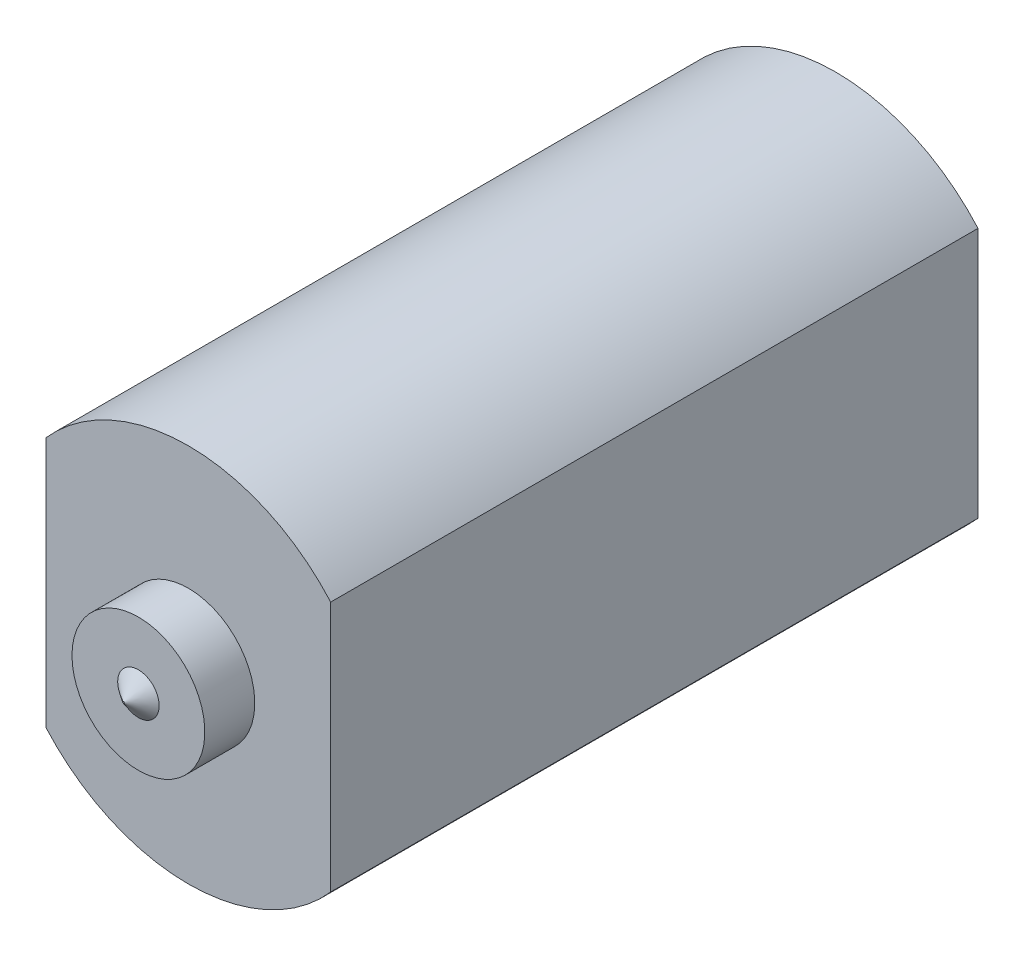
ISO-10303-21;
HEADER;
FILE_DESCRIPTION(('STEP AP214'),'2;1');
FILE_NAME('part.step','',(''),(''),'','','');
FILE_SCHEMA(('AUTOMOTIVE_DESIGN { 1 0 10303 214 1 1 1 1 }'));
ENDSEC;
DATA;
#1=APPLICATION_CONTEXT('core data for automotive mechanical design processes');
#2=APPLICATION_PROTOCOL_DEFINITION('international standard','automotive_design',2000,#1);
#3=PRODUCT_CONTEXT('',#1,'mechanical');
#4=PRODUCT('Part','Part','',(#3));
#5=PRODUCT_RELATED_PRODUCT_CATEGORY('part','',(#4));
#6=PRODUCT_DEFINITION_FORMATION('','',#4);
#7=PRODUCT_DEFINITION_CONTEXT('part definition',#1,'design');
#8=PRODUCT_DEFINITION('design','',#6,#7);
#9=PRODUCT_DEFINITION_SHAPE('','',#8);
#10=(LENGTH_UNIT() NAMED_UNIT(*) SI_UNIT(.MILLI.,.METRE.));
#11=(NAMED_UNIT(*) PLANE_ANGLE_UNIT() SI_UNIT($,.RADIAN.));
#12=(NAMED_UNIT(*) SI_UNIT($,.STERADIAN.) SOLID_ANGLE_UNIT());
#13=UNCERTAINTY_MEASURE_WITH_UNIT(LENGTH_MEASURE(1.E-05),#10,'distance_accuracy_value','');
#14=(GEOMETRIC_REPRESENTATION_CONTEXT(3) GLOBAL_UNCERTAINTY_ASSIGNED_CONTEXT((#13)) GLOBAL_UNIT_ASSIGNED_CONTEXT((#10,
#11,#12)) REPRESENTATION_CONTEXT('',''));
#15=CARTESIAN_POINT('',(0.,0.,0.));
#16=DIRECTION('',(0.,0.,1.));
#17=DIRECTION('',(1.,0.,0.));
#18=AXIS2_PLACEMENT_3D('',#15,#16,#17);
#19=CARTESIAN_POINT('',(0.,0.,6.604));
#20=DIRECTION('',(0.,0.,1.));
#21=DIRECTION('',(1.,0.,0.));
#22=AXIS2_PLACEMENT_3D('',#19,#20,#21);
#23=PLANE('',#22);
#24=CARTESIAN_POINT('',(0.,0.,6.60400000003847));
#25=DIRECTION('',(0.,0.,-1.));
#26=DIRECTION('',(-1.,0.,0.));
#27=AXIS2_PLACEMENT_3D('',#24,#25,#26);
#28=CIRCLE('',#27,0.0857836917589339);
#29=CARTESIAN_POINT('',(-0.0857836917589339,0.,6.60400000003847));
#30=VERTEX_POINT('',#29);
#31=EDGE_CURVE('E19',#30,#30,#28,.T.);
#32=ORIENTED_EDGE('',*,*,#31,.F.);
#33=EDGE_LOOP('',(#32));
#34=FACE_BOUND('',#33,.T.);
#35=ADVANCED_FACE('F16',(#34),#23,.T.);
#36=CARTESIAN_POINT('',(0.,0.,5.07999999990716));
#37=DIRECTION('',(0.,0.,-1.));
#38=DIRECTION('',(-1.,0.,0.));
#39=AXIS2_PLACEMENT_3D('',#36,#37,#38);
#40=CONICAL_SURFACE('',#39,2.10820000012291,0.925024503566552);
#41=CARTESIAN_POINT('',(0.,0.,5.07999999999283));
#42=DIRECTION('',(0.,0.,-1.));
#43=DIRECTION('',(-1.,0.,0.));
#44=AXIS2_PLACEMENT_3D('',#41,#42,#43);
#45=CIRCLE('',#44,2.10820000000922);
#46=CARTESIAN_POINT('',(-2.10820000000922,0.,5.07999999999283));
#47=VERTEX_POINT('',#46);
#48=EDGE_CURVE('E91',#47,#47,#45,.T.);
#49=ORIENTED_EDGE('',*,*,#48,.F.);
#50=EDGE_LOOP('',(#49));
#51=FACE_BOUND('',#50,.T.);
#52=ORIENTED_EDGE('',*,*,#31,.T.);
#53=EDGE_LOOP('',(#52));
#54=FACE_BOUND('',#53,.T.);
#55=ADVANCED_FACE('F98',(#51,#54),#40,.T.);
#56=CARTESIAN_POINT('',(0.,0.,5.08));
#57=DIRECTION('',(0.,0.,1.));
#58=DIRECTION('',(1.,0.,0.));
#59=AXIS2_PLACEMENT_3D('',#56,#57,#58);
#60=PLANE('',#59);
#61=ORIENTED_EDGE('',*,*,#48,.T.);
#62=EDGE_LOOP('',(#61));
#63=FACE_BOUND('',#62,.T.);
#64=CARTESIAN_POINT('',(0.,0.,5.08));
#65=DIRECTION('',(0.,0.,-1.));
#66=DIRECTION('',(-1.,0.,0.));
#67=AXIS2_PLACEMENT_3D('',#64,#65,#66);
#68=CIRCLE('',#67,6.7564);
#69=CARTESIAN_POINT('',(-6.7564,0.,5.08));
#70=VERTEX_POINT('',#69);
#71=EDGE_CURVE('E65',#70,#70,#68,.T.);
#72=ORIENTED_EDGE('',*,*,#71,.F.);
#73=EDGE_LOOP('',(#72));
#74=FACE_BOUND('',#73,.T.);
#75=ADVANCED_FACE('F107',(#63,#74),#60,.T.);
#76=CARTESIAN_POINT('',(0.,0.,5.08));
#77=DIRECTION('',(0.,0.,-1.));
#78=DIRECTION('',(-1.,0.,0.));
#79=AXIS2_PLACEMENT_3D('',#76,#77,#78);
#80=CYLINDRICAL_SURFACE('',#79,6.7564);
#81=CARTESIAN_POINT('',(0.,0.,0.));
#82=DIRECTION('',(0.,0.,-1.));
#83=DIRECTION('',(-1.,0.,0.));
#84=AXIS2_PLACEMENT_3D('',#81,#82,#83);
#85=CIRCLE('',#84,6.7564);
#86=CARTESIAN_POINT('',(-6.7564,0.,0.));
#87=VERTEX_POINT('',#86);
#88=EDGE_CURVE('E64',#87,#87,#85,.T.);
#89=ORIENTED_EDGE('',*,*,#88,.F.);
#90=EDGE_LOOP('',(#89));
#91=FACE_BOUND('',#90,.T.);
#92=ORIENTED_EDGE('',*,*,#71,.T.);
#93=EDGE_LOOP('',(#92));
#94=FACE_BOUND('',#93,.T.);
#95=ADVANCED_FACE('F131',(#91,#94),#80,.T.);
#96=CARTESIAN_POINT('',(0.,0.,-65.8368));
#97=DIRECTION('',(0.,0.,1.));
#98=DIRECTION('',(1.,0.,0.));
#99=AXIS2_PLACEMENT_3D('',#96,#97,#98);
#100=CYLINDRICAL_SURFACE('',#99,19.304);
#101=CARTESIAN_POINT('',(0.,0.,-65.8368));
#102=DIRECTION('',(0.,0.,1.));
#103=DIRECTION('',(1.,0.,0.));
#104=AXIS2_PLACEMENT_3D('',#101,#102,#103);
#105=CIRCLE('',#104,19.304);
#106=CARTESIAN_POINT('',(14.478,12.7683958271977,-65.8368));
#107=VERTEX_POINT('',#106);
#108=CARTESIAN_POINT('',(-14.478,12.7683958271977,-65.8368));
#109=VERTEX_POINT('',#108);
#110=EDGE_CURVE('E83',#107,#109,#105,.T.);
#111=ORIENTED_EDGE('',*,*,#110,.T.);
#112=DIRECTION('',(0.,0.,1.));
#113=VECTOR('',#112,1.);
#114=CARTESIAN_POINT('',(-14.478,12.7683958271977,-65.8368));
#115=LINE('',#114,#113);
#116=CARTESIAN_POINT('',(-14.478,12.7683958271977,0.));
#117=VERTEX_POINT('',#116);
#118=EDGE_CURVE('E61',#117,#109,#115,.F.);
#119=ORIENTED_EDGE('',*,*,#118,.F.);
#120=CARTESIAN_POINT('',(0.,0.,0.));
#121=DIRECTION('',(0.,0.,1.));
#122=DIRECTION('',(1.,0.,0.));
#123=AXIS2_PLACEMENT_3D('',#120,#121,#122);
#124=CIRCLE('',#123,19.304);
#125=CARTESIAN_POINT('',(14.478,12.7683958271977,0.));
#126=VERTEX_POINT('',#125);
#127=EDGE_CURVE('E55',#126,#117,#124,.T.);
#128=ORIENTED_EDGE('',*,*,#127,.F.);
#129=DIRECTION('',(0.,0.,-1.));
#130=VECTOR('',#129,1.);
#131=CARTESIAN_POINT('',(14.478,12.7683958271977,-65.8368));
#132=LINE('',#131,#130);
#133=EDGE_CURVE('E59',#107,#126,#132,.F.);
#134=ORIENTED_EDGE('',*,*,#133,.F.);
#135=EDGE_LOOP('',(#111,#119,#128,#134));
#136=FACE_BOUND('',#135,.T.);
#137=ADVANCED_FACE('F57',(#136),#100,.T.);
#138=CARTESIAN_POINT('',(0.,-42.6102213562373,0.));
#139=DIRECTION('',(0.,0.,1.));
#140=DIRECTION('',(1.,0.,0.));
#141=AXIS2_PLACEMENT_3D('',#138,#139,#140);
#142=PLANE('',#141);
#143=ORIENTED_EDGE('',*,*,#88,.T.);
#144=EDGE_LOOP('',(#143));
#145=FACE_BOUND('',#144,.T.);
#146=DIRECTION('',(0.,1.,0.));
#147=VECTOR('',#146,1.);
#148=CARTESIAN_POINT('',(-14.478,-42.6102213562373,0.));
#149=LINE('',#148,#147);
#150=CARTESIAN_POINT('',(-14.478,-12.7683958271977,0.));
#151=VERTEX_POINT('',#150);
#152=EDGE_CURVE('E84',#151,#117,#149,.T.);
#153=ORIENTED_EDGE('',*,*,#152,.F.);
#154=CARTESIAN_POINT('',(0.,0.,0.));
#155=DIRECTION('',(0.,0.,1.));
#156=DIRECTION('',(1.,0.,0.));
#157=AXIS2_PLACEMENT_3D('',#154,#155,#156);
#158=CIRCLE('',#157,19.304);
#159=CARTESIAN_POINT('',(14.478,-12.7683958271977,0.));
#160=VERTEX_POINT('',#159);
#161=EDGE_CURVE('E71',#160,#151,#158,.F.);
#162=ORIENTED_EDGE('',*,*,#161,.F.);
#163=DIRECTION('',(0.,1.,0.));
#164=VECTOR('',#163,1.);
#165=CARTESIAN_POINT('',(14.478,-42.6102213562373,0.));
#166=LINE('',#165,#164);
#167=EDGE_CURVE('E68',#126,#160,#166,.F.);
#168=ORIENTED_EDGE('',*,*,#167,.F.);
#169=ORIENTED_EDGE('',*,*,#127,.T.);
#170=EDGE_LOOP('',(#153,#162,#168,#169));
#171=FACE_BOUND('',#170,.T.);
#172=ADVANCED_FACE('F69',(#145,#171),#142,.T.);
#173=CARTESIAN_POINT('',(-14.478,-42.6102213562373,-65.8368));
#174=DIRECTION('',(-1.,0.,0.));
#175=DIRECTION('',(0.,0.,1.));
#176=AXIS2_PLACEMENT_3D('',#173,#174,#175);
#177=PLANE('',#176);
#178=DIRECTION('',(0.,1.,0.));
#179=VECTOR('',#178,1.);
#180=CARTESIAN_POINT('',(-14.478,-42.6102213562373,-65.8368));
#181=LINE('',#180,#179);
#182=CARTESIAN_POINT('',(-14.478,-12.7683958271977,-65.8368));
#183=VERTEX_POINT('',#182);
#184=EDGE_CURVE('E73',#109,#183,#181,.F.);
#185=ORIENTED_EDGE('',*,*,#184,.T.);
#186=DIRECTION('',(0.,0.,1.));
#187=VECTOR('',#186,1.);
#188=CARTESIAN_POINT('',(-14.478,-12.7683958271977,-65.8368));
#189=LINE('',#188,#187);
#190=EDGE_CURVE('E77',#151,#183,#189,.F.);
#191=ORIENTED_EDGE('',*,*,#190,.F.);
#192=ORIENTED_EDGE('',*,*,#152,.T.);
#193=ORIENTED_EDGE('',*,*,#118,.T.);
#194=EDGE_LOOP('',(#185,#191,#192,#193));
#195=FACE_BOUND('',#194,.T.);
#196=ADVANCED_FACE('F122',(#195),#177,.T.);
#197=CARTESIAN_POINT('',(0.,-42.6102213562373,-65.8368));
#198=DIRECTION('',(0.,0.,1.));
#199=DIRECTION('',(1.,0.,0.));
#200=AXIS2_PLACEMENT_3D('',#197,#198,#199);
#201=PLANE('',#200);
#202=CARTESIAN_POINT('',(0.,0.,-65.8368));
#203=DIRECTION('',(0.,0.,1.));
#204=DIRECTION('',(1.,0.,0.));
#205=AXIS2_PLACEMENT_3D('',#202,#203,#204);
#206=CIRCLE('',#205,19.304);
#207=CARTESIAN_POINT('',(14.478,-12.7683958271977,-65.8368));
#208=VERTEX_POINT('',#207);
#209=EDGE_CURVE('E25',#183,#208,#206,.T.);
#210=ORIENTED_EDGE('',*,*,#209,.F.);
#211=ORIENTED_EDGE('',*,*,#184,.F.);
#212=ORIENTED_EDGE('',*,*,#110,.F.);
#213=DIRECTION('',(0.,1.,0.));
#214=VECTOR('',#213,1.);
#215=CARTESIAN_POINT('',(14.478,-42.6102213562373,-65.8368));
#216=LINE('',#215,#214);
#217=EDGE_CURVE('E34',#208,#107,#216,.T.);
#218=ORIENTED_EDGE('',*,*,#217,.F.);
#219=EDGE_LOOP('',(#210,#211,#212,#218));
#220=FACE_BOUND('',#219,.T.);
#221=ADVANCED_FACE('F117',(#220),#201,.F.);
#222=CARTESIAN_POINT('',(14.478,-42.6102213562373,-65.8368));
#223=DIRECTION('',(1.,0.,0.));
#224=DIRECTION('',(0.,0.,-1.));
#225=AXIS2_PLACEMENT_3D('',#222,#223,#224);
#226=PLANE('',#225);
#227=ORIENTED_EDGE('',*,*,#217,.T.);
#228=ORIENTED_EDGE('',*,*,#133,.T.);
#229=ORIENTED_EDGE('',*,*,#167,.T.);
#230=DIRECTION('',(0.,0.,1.));
#231=VECTOR('',#230,1.);
#232=CARTESIAN_POINT('',(14.478,-12.7683958271977,-65.8368));
#233=LINE('',#232,#231);
#234=EDGE_CURVE('E11',#208,#160,#233,.T.);
#235=ORIENTED_EDGE('',*,*,#234,.F.);
#236=EDGE_LOOP('',(#227,#228,#229,#235));
#237=FACE_BOUND('',#236,.T.);
#238=ADVANCED_FACE('F75',(#237),#226,.T.);
#239=CARTESIAN_POINT('',(0.,0.,-65.8368));
#240=DIRECTION('',(0.,0.,1.));
#241=DIRECTION('',(1.,0.,0.));
#242=AXIS2_PLACEMENT_3D('',#239,#240,#241);
#243=CYLINDRICAL_SURFACE('',#242,19.304);
#244=ORIENTED_EDGE('',*,*,#209,.T.);
#245=ORIENTED_EDGE('',*,*,#234,.T.);
#246=ORIENTED_EDGE('',*,*,#161,.T.);
#247=ORIENTED_EDGE('',*,*,#190,.T.);
#248=EDGE_LOOP('',(#244,#245,#246,#247));
#249=FACE_BOUND('',#248,.T.);
#250=ADVANCED_FACE('F109',(#249),#243,.T.);
#251=CLOSED_SHELL('',(#35,#55,#75,#95,#137,#172,#196,#221,#238,#250));
#252=MANIFOLD_SOLID_BREP('B1',#251);
#253=ADVANCED_BREP_SHAPE_REPRESENTATION('',(#18,#252),#14);
#254=SHAPE_DEFINITION_REPRESENTATION(#9,#253);
ENDSEC;
END-ISO-10303-21;
